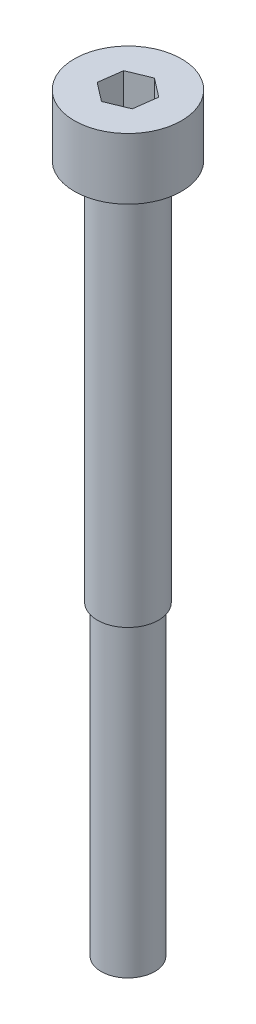
ISO-10303-21;
HEADER;
FILE_DESCRIPTION(('STEP AP214'),'2;1');
FILE_NAME('part.step','',(''),(''),'','','');
FILE_SCHEMA(('AUTOMOTIVE_DESIGN { 1 0 10303 214 1 1 1 1 }'));
ENDSEC;
DATA;
#1=APPLICATION_CONTEXT('core data for automotive mechanical design processes');
#2=APPLICATION_PROTOCOL_DEFINITION('international standard','automotive_design',2000,#1);
#3=PRODUCT_CONTEXT('',#1,'mechanical');
#4=PRODUCT('Part','Part','',(#3));
#5=PRODUCT_RELATED_PRODUCT_CATEGORY('part','',(#4));
#6=PRODUCT_DEFINITION_FORMATION('','',#4);
#7=PRODUCT_DEFINITION_CONTEXT('part definition',#1,'design');
#8=PRODUCT_DEFINITION('design','',#6,#7);
#9=PRODUCT_DEFINITION_SHAPE('','',#8);
#10=(LENGTH_UNIT() NAMED_UNIT(*) SI_UNIT(.MILLI.,.METRE.));
#11=(NAMED_UNIT(*) PLANE_ANGLE_UNIT() SI_UNIT($,.RADIAN.));
#12=(NAMED_UNIT(*) SI_UNIT($,.STERADIAN.) SOLID_ANGLE_UNIT());
#13=UNCERTAINTY_MEASURE_WITH_UNIT(LENGTH_MEASURE(1.E-05),#10,'distance_accuracy_value','');
#14=(GEOMETRIC_REPRESENTATION_CONTEXT(3) GLOBAL_UNCERTAINTY_ASSIGNED_CONTEXT((#13)) GLOBAL_UNIT_ASSIGNED_CONTEXT((#10,
#11,#12)) REPRESENTATION_CONTEXT('',''));
#15=CARTESIAN_POINT('',(0.,0.,0.));
#16=DIRECTION('',(0.,0.,1.));
#17=DIRECTION('',(1.,0.,0.));
#18=AXIS2_PLACEMENT_3D('',#15,#16,#17);
#19=CARTESIAN_POINT('',(0.,25.,0.));
#20=DIRECTION('',(0.,-1.,0.));
#21=DIRECTION('',(0.,0.,-1.));
#22=AXIS2_PLACEMENT_3D('',#19,#20,#21);
#23=CYLINDRICAL_SURFACE('',#22,2.);
#24=CARTESIAN_POINT('',(0.,25.,0.));
#25=DIRECTION('',(0.,1.,0.));
#26=DIRECTION('',(0.,0.,1.));
#27=AXIS2_PLACEMENT_3D('',#24,#25,#26);
#28=CIRCLE('',#27,2.);
#29=CARTESIAN_POINT('',(0.,25.,2.));
#30=VERTEX_POINT('',#29);
#31=EDGE_CURVE('E11',#30,#30,#28,.T.);
#32=ORIENTED_EDGE('',*,*,#31,.F.);
#33=EDGE_LOOP('',(#32));
#34=FACE_BOUND('',#33,.T.);
#35=CARTESIAN_POINT('',(0.,0.,0.));
#36=DIRECTION('',(0.,1.,0.));
#37=DIRECTION('',(0.,0.,1.));
#38=AXIS2_PLACEMENT_3D('',#35,#36,#37);
#39=CIRCLE('',#38,2.);
#40=CARTESIAN_POINT('',(0.,0.,2.));
#41=VERTEX_POINT('',#40);
#42=EDGE_CURVE('E44',#41,#41,#39,.T.);
#43=ORIENTED_EDGE('',*,*,#42,.T.);
#44=EDGE_LOOP('',(#43));
#45=FACE_BOUND('',#44,.T.);
#46=ADVANCED_FACE('F41',(#34,#45),#23,.T.);
#47=CARTESIAN_POINT('',(0.,0.,0.));
#48=DIRECTION('',(0.,1.,0.));
#49=DIRECTION('',(0.,0.,1.));
#50=AXIS2_PLACEMENT_3D('',#47,#48,#49);
#51=PLANE('',#50);
#52=CARTESIAN_POINT('',(0.,0.,0.));
#53=DIRECTION('',(0.,1.,0.));
#54=DIRECTION('',(0.,0.,1.));
#55=AXIS2_PLACEMENT_3D('',#52,#53,#54);
#56=CIRCLE('',#55,1.75);
#57=CARTESIAN_POINT('',(0.,0.,1.75));
#58=VERTEX_POINT('',#57);
#59=EDGE_CURVE('E169',#58,#58,#56,.T.);
#60=ORIENTED_EDGE('',*,*,#59,.T.);
#61=EDGE_LOOP('',(#60));
#62=FACE_BOUND('',#61,.T.);
#63=ORIENTED_EDGE('',*,*,#42,.F.);
#64=EDGE_LOOP('',(#63));
#65=FACE_BOUND('',#64,.T.);
#66=ADVANCED_FACE('F181',(#62,#65),#51,.F.);
#67=CARTESIAN_POINT('',(0.,-20.,0.));
#68=DIRECTION('',(0.,1.,0.));
#69=DIRECTION('',(0.,0.,1.));
#70=AXIS2_PLACEMENT_3D('',#67,#68,#69);
#71=CYLINDRICAL_SURFACE('',#70,1.75);
#72=CARTESIAN_POINT('',(0.,-20.,0.));
#73=DIRECTION('',(0.,1.,0.));
#74=DIRECTION('',(0.,0.,1.));
#75=AXIS2_PLACEMENT_3D('',#72,#73,#74);
#76=CIRCLE('',#75,1.75);
#77=CARTESIAN_POINT('',(0.,-20.,1.75));
#78=VERTEX_POINT('',#77);
#79=EDGE_CURVE('E173',#78,#78,#76,.T.);
#80=ORIENTED_EDGE('',*,*,#79,.T.);
#81=EDGE_LOOP('',(#80));
#82=FACE_BOUND('',#81,.T.);
#83=ORIENTED_EDGE('',*,*,#59,.F.);
#84=EDGE_LOOP('',(#83));
#85=FACE_BOUND('',#84,.T.);
#86=ADVANCED_FACE('F184',(#82,#85),#71,.T.);
#87=CARTESIAN_POINT('',(0.,-20.,0.));
#88=DIRECTION('',(0.,1.,0.));
#89=DIRECTION('',(0.,0.,1.));
#90=AXIS2_PLACEMENT_3D('',#87,#88,#89);
#91=PLANE('',#90);
#92=ORIENTED_EDGE('',*,*,#79,.F.);
#93=EDGE_LOOP('',(#92));
#94=FACE_BOUND('',#93,.T.);
#95=ADVANCED_FACE('F186',(#94),#91,.F.);
#96=CARTESIAN_POINT('',(0.,29.,0.));
#97=DIRECTION('',(0.,-1.,0.));
#98=DIRECTION('',(0.,0.,-1.));
#99=AXIS2_PLACEMENT_3D('',#96,#97,#98);
#100=CYLINDRICAL_SURFACE('',#99,3.5);
#101=CARTESIAN_POINT('',(0.,29.,0.));
#102=DIRECTION('',(0.,1.,0.));
#103=DIRECTION('',(0.,0.,1.));
#104=AXIS2_PLACEMENT_3D('',#101,#102,#103);
#105=CIRCLE('',#104,3.5);
#106=CARTESIAN_POINT('',(0.,29.,3.5));
#107=VERTEX_POINT('',#106);
#108=EDGE_CURVE('E165',#107,#107,#105,.T.);
#109=ORIENTED_EDGE('',*,*,#108,.F.);
#110=EDGE_LOOP('',(#109));
#111=FACE_BOUND('',#110,.T.);
#112=CARTESIAN_POINT('',(0.,25.,0.));
#113=DIRECTION('',(0.,1.,0.));
#114=DIRECTION('',(0.,0.,1.));
#115=AXIS2_PLACEMENT_3D('',#112,#113,#114);
#116=CIRCLE('',#115,3.5);
#117=CARTESIAN_POINT('',(0.,25.,3.5));
#118=VERTEX_POINT('',#117);
#119=EDGE_CURVE('E155',#118,#118,#116,.T.);
#120=ORIENTED_EDGE('',*,*,#119,.T.);
#121=EDGE_LOOP('',(#120));
#122=FACE_BOUND('',#121,.T.);
#123=ADVANCED_FACE('F193',(#111,#122),#100,.T.);
#124=CARTESIAN_POINT('',(0.,29.,0.));
#125=DIRECTION('',(0.,1.,0.));
#126=DIRECTION('',(0.,0.,1.));
#127=AXIS2_PLACEMENT_3D('',#124,#125,#126);
#128=PLANE('',#127);
#129=DIRECTION('',(0.924428139923826,0.,-0.381356282388234));
#130=VECTOR('',#129,1.);
#131=CARTESIAN_POINT('',(-0.203202755942202,29.,1.52653484728567));
#132=LINE('',#131,#130);
#133=CARTESIAN_POINT('',(-0.203202755942202,29.,1.52653484728567));
#134=VERTEX_POINT('',#133);
#135=CARTESIAN_POINT('',(1.22041657954049,29.,0.939246172407794));
#136=VERTEX_POINT('',#135);
#137=EDGE_CURVE('E56',#134,#136,#132,.T.);
#138=ORIENTED_EDGE('',*,*,#137,.F.);
#139=DIRECTION('',(0.792478298402916,0.,0.609900111953112));
#140=VECTOR('',#139,1.);
#141=CARTESIAN_POINT('',(-1.42361933548269,29.,0.58728867487788));
#142=LINE('',#141,#140);
#143=CARTESIAN_POINT('',(-1.42361933548269,29.,0.58728867487788));
#144=VERTEX_POINT('',#143);
#145=EDGE_CURVE('E149',#144,#134,#142,.T.);
#146=ORIENTED_EDGE('',*,*,#145,.F.);
#147=DIRECTION('',(-0.131949841520911,0.,0.991256394341346));
#148=VECTOR('',#147,1.);
#149=CARTESIAN_POINT('',(-1.22041657954049,29.,-0.939246172407793));
#150=LINE('',#149,#148);
#151=CARTESIAN_POINT('',(-1.22041657954049,29.,-0.939246172407793));
#152=VERTEX_POINT('',#151);
#153=EDGE_CURVE('E146',#152,#144,#150,.T.);
#154=ORIENTED_EDGE('',*,*,#153,.F.);
#155=DIRECTION('',(-0.924428139923826,0.,0.381356282388234));
#156=VECTOR('',#155,1.);
#157=CARTESIAN_POINT('',(0.203202755942202,29.,-1.52653484728567));
#158=LINE('',#157,#156);
#159=CARTESIAN_POINT('',(0.203202755942202,29.,-1.52653484728567));
#160=VERTEX_POINT('',#159);
#161=EDGE_CURVE('E104',#160,#152,#158,.T.);
#162=ORIENTED_EDGE('',*,*,#161,.F.);
#163=DIRECTION('',(-0.792478298402916,0.,-0.609900111953113));
#164=VECTOR('',#163,1.);
#165=CARTESIAN_POINT('',(1.42361933548269,29.,-0.58728867487788));
#166=LINE('',#165,#164);
#167=CARTESIAN_POINT('',(1.42361933548269,29.,-0.58728867487788));
#168=VERTEX_POINT('',#167);
#169=EDGE_CURVE('E140',#168,#160,#166,.T.);
#170=ORIENTED_EDGE('',*,*,#169,.F.);
#171=DIRECTION('',(0.13194984152091,0.,-0.991256394341346));
#172=VECTOR('',#171,1.);
#173=CARTESIAN_POINT('',(1.22041657954049,29.,0.939246172407794));
#174=LINE('',#173,#172);
#175=EDGE_CURVE('E136',#136,#168,#174,.T.);
#176=ORIENTED_EDGE('',*,*,#175,.F.);
#177=EDGE_LOOP('',(#138,#146,#154,#162,#170,#176));
#178=FACE_BOUND('',#177,.T.);
#179=ORIENTED_EDGE('',*,*,#108,.T.);
#180=EDGE_LOOP('',(#179));
#181=FACE_BOUND('',#180,.T.);
#182=ADVANCED_FACE('F210',(#178,#181),#128,.T.);
#183=CARTESIAN_POINT('',(0.,25.,0.));
#184=DIRECTION('',(0.,1.,0.));
#185=DIRECTION('',(0.,0.,1.));
#186=AXIS2_PLACEMENT_3D('',#183,#184,#185);
#187=PLANE('',#186);
#188=ORIENTED_EDGE('',*,*,#31,.T.);
#189=EDGE_LOOP('',(#188));
#190=FACE_BOUND('',#189,.T.);
#191=ORIENTED_EDGE('',*,*,#119,.F.);
#192=EDGE_LOOP('',(#191));
#193=FACE_BOUND('',#192,.T.);
#194=ADVANCED_FACE('F206',(#190,#193),#187,.F.);
#195=CARTESIAN_POINT('',(-0.203202755942202,26.,1.52653484728567));
#196=DIRECTION('',(0.381356282388234,0.,0.924428139923827));
#197=DIRECTION('',(0.924428139923827,0.,-0.381356282388234));
#198=AXIS2_PLACEMENT_3D('',#195,#196,#197);
#199=PLANE('',#198);
#200=ORIENTED_EDGE('',*,*,#137,.T.);
#201=DIRECTION('',(0.,1.,0.));
#202=VECTOR('',#201,1.);
#203=CARTESIAN_POINT('',(1.22041657954049,26.,0.939246172407794));
#204=LINE('',#203,#202);
#205=CARTESIAN_POINT('',(1.22041657954049,26.,0.939246172407794));
#206=VERTEX_POINT('',#205);
#207=EDGE_CURVE('E86',#206,#136,#204,.T.);
#208=ORIENTED_EDGE('',*,*,#207,.F.);
#209=DIRECTION('',(0.924428139923826,0.,-0.381356282388234));
#210=VECTOR('',#209,1.);
#211=CARTESIAN_POINT('',(-0.203202755942202,26.,1.52653484728567));
#212=LINE('',#211,#210);
#213=CARTESIAN_POINT('',(-0.203202755942202,26.,1.52653484728567));
#214=VERTEX_POINT('',#213);
#215=EDGE_CURVE('E152',#214,#206,#212,.T.);
#216=ORIENTED_EDGE('',*,*,#215,.F.);
#217=DIRECTION('',(0.,1.,0.));
#218=VECTOR('',#217,1.);
#219=CARTESIAN_POINT('',(-0.203202755942202,26.,1.52653484728567));
#220=LINE('',#219,#218);
#221=EDGE_CURVE('E64',#214,#134,#220,.T.);
#222=ORIENTED_EDGE('',*,*,#221,.T.);
#223=EDGE_LOOP('',(#200,#208,#216,#222));
#224=FACE_BOUND('',#223,.T.);
#225=ADVANCED_FACE('F209',(#224),#199,.F.);
#226=CARTESIAN_POINT('',(-1.42361933548269,26.,0.58728867487788));
#227=DIRECTION('',(-0.609900111953112,0.,0.792478298402916));
#228=DIRECTION('',(0.792478298402916,0.,0.609900111953112));
#229=AXIS2_PLACEMENT_3D('',#226,#227,#228);
#230=PLANE('',#229);
#231=ORIENTED_EDGE('',*,*,#145,.T.);
#232=ORIENTED_EDGE('',*,*,#221,.F.);
#233=DIRECTION('',(0.792478298402916,0.,0.609900111953112));
#234=VECTOR('',#233,1.);
#235=CARTESIAN_POINT('',(-1.42361933548269,26.,0.58728867487788));
#236=LINE('',#235,#234);
#237=CARTESIAN_POINT('',(-1.42361933548269,26.,0.58728867487788));
#238=VERTEX_POINT('',#237);
#239=EDGE_CURVE('E118',#238,#214,#236,.T.);
#240=ORIENTED_EDGE('',*,*,#239,.F.);
#241=DIRECTION('',(0.,1.,0.));
#242=VECTOR('',#241,1.);
#243=CARTESIAN_POINT('',(-1.42361933548269,26.,0.58728867487788));
#244=LINE('',#243,#242);
#245=EDGE_CURVE('E109',#238,#144,#244,.T.);
#246=ORIENTED_EDGE('',*,*,#245,.T.);
#247=EDGE_LOOP('',(#231,#232,#240,#246));
#248=FACE_BOUND('',#247,.T.);
#249=ADVANCED_FACE('F226',(#248),#230,.F.);
#250=CARTESIAN_POINT('',(-1.22041657954049,26.,-0.939246172407793));
#251=DIRECTION('',(-0.991256394341346,0.,-0.131949841520911));
#252=DIRECTION('',(-0.131949841520911,0.,0.991256394341346));
#253=AXIS2_PLACEMENT_3D('',#250,#251,#252);
#254=PLANE('',#253);
#255=ORIENTED_EDGE('',*,*,#153,.T.);
#256=ORIENTED_EDGE('',*,*,#245,.F.);
#257=DIRECTION('',(-0.131949841520911,0.,0.991256394341346));
#258=VECTOR('',#257,1.);
#259=CARTESIAN_POINT('',(-1.22041657954049,26.,-0.939246172407793));
#260=LINE('',#259,#258);
#261=CARTESIAN_POINT('',(-1.22041657954049,26.,-0.939246172407793));
#262=VERTEX_POINT('',#261);
#263=EDGE_CURVE('E113',#262,#238,#260,.T.);
#264=ORIENTED_EDGE('',*,*,#263,.F.);
#265=DIRECTION('',(0.,1.,0.));
#266=VECTOR('',#265,1.);
#267=CARTESIAN_POINT('',(-1.22041657954049,26.,-0.939246172407793));
#268=LINE('',#267,#266);
#269=EDGE_CURVE('E97',#262,#152,#268,.T.);
#270=ORIENTED_EDGE('',*,*,#269,.T.);
#271=EDGE_LOOP('',(#255,#256,#264,#270));
#272=FACE_BOUND('',#271,.T.);
#273=ADVANCED_FACE('F114',(#272),#254,.F.);
#274=CARTESIAN_POINT('',(0.203202755942202,26.,-1.52653484728567));
#275=DIRECTION('',(-0.381356282388234,0.,-0.924428139923826));
#276=DIRECTION('',(-0.924428139923826,0.,0.381356282388234));
#277=AXIS2_PLACEMENT_3D('',#274,#275,#276);
#278=PLANE('',#277);
#279=ORIENTED_EDGE('',*,*,#161,.T.);
#280=ORIENTED_EDGE('',*,*,#269,.F.);
#281=DIRECTION('',(-0.924428139923826,0.,0.381356282388234));
#282=VECTOR('',#281,1.);
#283=CARTESIAN_POINT('',(0.203202755942202,26.,-1.52653484728567));
#284=LINE('',#283,#282);
#285=CARTESIAN_POINT('',(0.203202755942202,26.,-1.52653484728567));
#286=VERTEX_POINT('',#285);
#287=EDGE_CURVE('E101',#286,#262,#284,.T.);
#288=ORIENTED_EDGE('',*,*,#287,.F.);
#289=DIRECTION('',(0.,1.,0.));
#290=VECTOR('',#289,1.);
#291=CARTESIAN_POINT('',(0.203202755942202,26.,-1.52653484728567));
#292=LINE('',#291,#290);
#293=EDGE_CURVE('E110',#286,#160,#292,.T.);
#294=ORIENTED_EDGE('',*,*,#293,.T.);
#295=EDGE_LOOP('',(#279,#280,#288,#294));
#296=FACE_BOUND('',#295,.T.);
#297=ADVANCED_FACE('F99',(#296),#278,.F.);
#298=CARTESIAN_POINT('',(1.42361933548269,26.,-0.58728867487788));
#299=DIRECTION('',(0.609900111953112,0.,-0.792478298402916));
#300=DIRECTION('',(-0.792478298402916,0.,-0.609900111953113));
#301=AXIS2_PLACEMENT_3D('',#298,#299,#300);
#302=PLANE('',#301);
#303=ORIENTED_EDGE('',*,*,#169,.T.);
#304=ORIENTED_EDGE('',*,*,#293,.F.);
#305=DIRECTION('',(-0.792478298402916,0.,-0.609900111953113));
#306=VECTOR('',#305,1.);
#307=CARTESIAN_POINT('',(1.42361933548269,26.,-0.58728867487788));
#308=LINE('',#307,#306);
#309=CARTESIAN_POINT('',(1.42361933548269,26.,-0.58728867487788));
#310=VERTEX_POINT('',#309);
#311=EDGE_CURVE('E124',#310,#286,#308,.T.);
#312=ORIENTED_EDGE('',*,*,#311,.F.);
#313=DIRECTION('',(0.,1.,0.));
#314=VECTOR('',#313,1.);
#315=CARTESIAN_POINT('',(1.42361933548269,26.,-0.58728867487788));
#316=LINE('',#315,#314);
#317=EDGE_CURVE('E160',#310,#168,#316,.T.);
#318=ORIENTED_EDGE('',*,*,#317,.T.);
#319=EDGE_LOOP('',(#303,#304,#312,#318));
#320=FACE_BOUND('',#319,.T.);
#321=ADVANCED_FACE('F230',(#320),#302,.F.);
#322=CARTESIAN_POINT('',(1.22041657954049,26.,0.939246172407794));
#323=DIRECTION('',(0.991256394341346,0.,0.13194984152091));
#324=DIRECTION('',(0.13194984152091,0.,-0.991256394341346));
#325=AXIS2_PLACEMENT_3D('',#322,#323,#324);
#326=PLANE('',#325);
#327=ORIENTED_EDGE('',*,*,#175,.T.);
#328=ORIENTED_EDGE('',*,*,#317,.F.);
#329=DIRECTION('',(0.13194984152091,0.,-0.991256394341346));
#330=VECTOR('',#329,1.);
#331=CARTESIAN_POINT('',(1.22041657954049,26.,0.939246172407794));
#332=LINE('',#331,#330);
#333=EDGE_CURVE('E128',#206,#310,#332,.T.);
#334=ORIENTED_EDGE('',*,*,#333,.F.);
#335=ORIENTED_EDGE('',*,*,#207,.T.);
#336=EDGE_LOOP('',(#327,#328,#334,#335));
#337=FACE_BOUND('',#336,.T.);
#338=ADVANCED_FACE('F227',(#337),#326,.F.);
#339=CARTESIAN_POINT('',(0.,26.,0.));
#340=DIRECTION('',(0.,1.,0.));
#341=DIRECTION('',(0.,0.,1.));
#342=AXIS2_PLACEMENT_3D('',#339,#340,#341);
#343=PLANE('',#342);
#344=ORIENTED_EDGE('',*,*,#215,.T.);
#345=ORIENTED_EDGE('',*,*,#333,.T.);
#346=ORIENTED_EDGE('',*,*,#311,.T.);
#347=ORIENTED_EDGE('',*,*,#287,.T.);
#348=ORIENTED_EDGE('',*,*,#263,.T.);
#349=ORIENTED_EDGE('',*,*,#239,.T.);
#350=EDGE_LOOP('',(#344,#345,#346,#347,#348,#349));
#351=FACE_BOUND('',#350,.T.);
#352=ADVANCED_FACE('F121',(#351),#343,.T.);
#353=CLOSED_SHELL('',(#46,#66,#86,#95,#123,#182,#194,#225,#249,#273,#297,#321,#338,#352));
#354=MANIFOLD_SOLID_BREP('B2',#353);
#355=ADVANCED_BREP_SHAPE_REPRESENTATION('',(#18,#354),#14);
#356=SHAPE_DEFINITION_REPRESENTATION(#9,#355);
ENDSEC;
END-ISO-10303-21;
